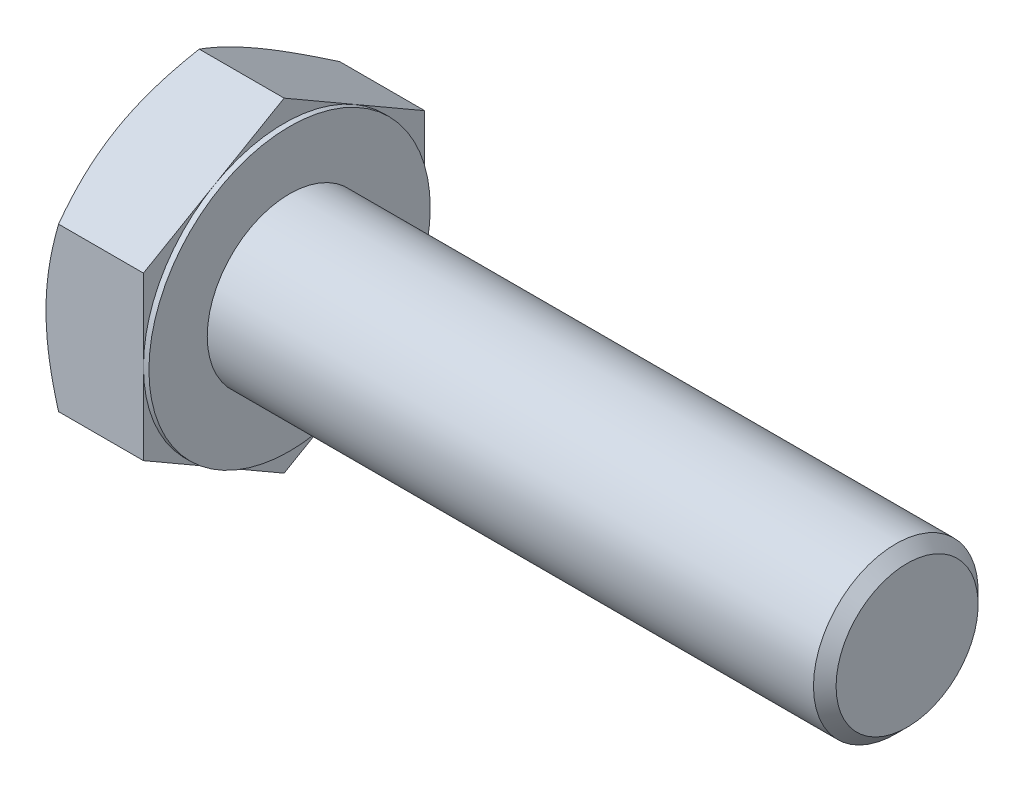
ISO-10303-21;
HEADER;
FILE_DESCRIPTION(('STEP AP214'),'2;1');
FILE_NAME('part.step','',(''),(''),'','','');
FILE_SCHEMA(('AUTOMOTIVE_DESIGN { 1 0 10303 214 1 1 1 1 }'));
ENDSEC;
DATA;
#1=APPLICATION_CONTEXT('core data for automotive mechanical design processes');
#2=APPLICATION_PROTOCOL_DEFINITION('international standard','automotive_design',2000,#1);
#3=PRODUCT_CONTEXT('',#1,'mechanical');
#4=PRODUCT('Part','Part','',(#3));
#5=PRODUCT_RELATED_PRODUCT_CATEGORY('part','',(#4));
#6=PRODUCT_DEFINITION_FORMATION('','',#4);
#7=PRODUCT_DEFINITION_CONTEXT('part definition',#1,'design');
#8=PRODUCT_DEFINITION('design','',#6,#7);
#9=PRODUCT_DEFINITION_SHAPE('','',#8);
#10=(LENGTH_UNIT() NAMED_UNIT(*) SI_UNIT(.MILLI.,.METRE.));
#11=(NAMED_UNIT(*) PLANE_ANGLE_UNIT() SI_UNIT($,.RADIAN.));
#12=(NAMED_UNIT(*) SI_UNIT($,.STERADIAN.) SOLID_ANGLE_UNIT());
#13=UNCERTAINTY_MEASURE_WITH_UNIT(LENGTH_MEASURE(1.E-05),#10,'distance_accuracy_value','');
#14=(GEOMETRIC_REPRESENTATION_CONTEXT(3) GLOBAL_UNCERTAINTY_ASSIGNED_CONTEXT((#13)) GLOBAL_UNIT_ASSIGNED_CONTEXT((#10,
#11,#12)) REPRESENTATION_CONTEXT('',''));
#15=CARTESIAN_POINT('',(0.,0.,0.));
#16=DIRECTION('',(0.,0.,1.));
#17=DIRECTION('',(1.,0.,0.));
#18=AXIS2_PLACEMENT_3D('',#15,#16,#17);
#19=CARTESIAN_POINT('',(-4.47600888718708,4.97835272816649,2.05991909307157));
#20=DIRECTION('',(1.,0.,0.));
#21=DIRECTION('',(0.,0.,-1.));
#22=AXIS2_PLACEMENT_3D('',#19,#20,#21);
#23=PLANE('',#22);
#24=CARTESIAN_POINT('',(-4.47600888718708,2.01943259856965,2.05991909307157));
#25=DIRECTION('',(1.,0.,0.));
#26=DIRECTION('',(0.,0.,-1.));
#27=AXIS2_PLACEMENT_3D('',#24,#25,#26);
#28=CIRCLE('',#27,1.5);
#29=CARTESIAN_POINT('',(-4.47600888718708,2.01943259856965,0.559919093071569));
#30=VERTEX_POINT('',#29);
#31=EDGE_CURVE('E278',#30,#30,#28,.F.);
#32=ORIENTED_EDGE('',*,*,#31,.T.);
#33=EDGE_LOOP('',(#32));
#34=FACE_BOUND('',#33,.T.);
#35=CARTESIAN_POINT('',(-4.47600888718708,2.01943259856965,2.05991909307157));
#36=DIRECTION('',(1.,0.,0.));
#37=DIRECTION('',(0.,0.,-1.));
#38=AXIS2_PLACEMENT_3D('',#35,#36,#37);
#39=CIRCLE('',#38,2.5625);
#40=CARTESIAN_POINT('',(-4.47600888718708,2.01943259856965,-0.502580906928431));
#41=VERTEX_POINT('',#40);
#42=EDGE_CURVE('E297',#41,#41,#39,.T.);
#43=ORIENTED_EDGE('',*,*,#42,.T.);
#44=EDGE_LOOP('',(#43));
#45=FACE_BOUND('',#44,.T.);
#46=ADVANCED_FACE('F34',(#34,#45),#23,.T.);
#47=CARTESIAN_POINT('',(-6.35100888718708,2.01943259856965,2.05991909307157));
#48=DIRECTION('',(-1.,0.,0.));
#49=DIRECTION('',(0.,0.,1.));
#50=AXIS2_PLACEMENT_3D('',#47,#48,#49);
#51=CYLINDRICAL_SURFACE('',#50,1.5);
#52=ORIENTED_EDGE('',*,*,#31,.F.);
#53=EDGE_LOOP('',(#52));
#54=FACE_BOUND('',#53,.T.);
#55=CARTESIAN_POINT('',(6.56799111281292,2.01943259856965,2.05991909307157));
#56=DIRECTION('',(-1.,0.,0.));
#57=DIRECTION('',(0.,0.,1.));
#58=AXIS2_PLACEMENT_3D('',#55,#56,#57);
#59=CIRCLE('',#58,1.5);
#60=CARTESIAN_POINT('',(6.56799111281292,2.01943259856965,3.55991909307157));
#61=VERTEX_POINT('',#60);
#62=EDGE_CURVE('E275',#61,#61,#59,.T.);
#63=ORIENTED_EDGE('',*,*,#62,.T.);
#64=EDGE_LOOP('',(#63));
#65=FACE_BOUND('',#64,.T.);
#66=ADVANCED_FACE('F249',(#54,#65),#51,.T.);
#67=CARTESIAN_POINT('',(6.77399111281292,2.01943259856965,2.05991909307157));
#68=DIRECTION('',(-1.,0.,0.));
#69=DIRECTION('',(0.,0.,1.));
#70=AXIS2_PLACEMENT_3D('',#67,#68,#69);
#71=CONICAL_SURFACE('',#70,1.294,0.785398163397449);
#72=ORIENTED_EDGE('',*,*,#62,.F.);
#73=EDGE_LOOP('',(#72));
#74=FACE_BOUND('',#73,.T.);
#75=CARTESIAN_POINT('',(6.77399111281292,2.01943259856965,2.05991909307157));
#76=DIRECTION('',(-1.,0.,0.));
#77=DIRECTION('',(0.,0.,1.));
#78=AXIS2_PLACEMENT_3D('',#75,#76,#77);
#79=CIRCLE('',#78,1.294);
#80=CARTESIAN_POINT('',(6.77399111281292,2.01943259856965,3.35391909307157));
#81=VERTEX_POINT('',#80);
#82=EDGE_CURVE('E273',#81,#81,#79,.T.);
#83=ORIENTED_EDGE('',*,*,#82,.T.);
#84=EDGE_LOOP('',(#83));
#85=FACE_BOUND('',#84,.T.);
#86=ADVANCED_FACE('F254',(#74,#85),#71,.T.);
#87=CARTESIAN_POINT('',(6.77399111281292,2.01943259856965,2.05991909307157));
#88=DIRECTION('',(-1.,0.,0.));
#89=DIRECTION('',(0.,0.,1.));
#90=AXIS2_PLACEMENT_3D('',#87,#88,#89);
#91=PLANE('',#90);
#92=ORIENTED_EDGE('',*,*,#82,.F.);
#93=EDGE_LOOP('',(#92));
#94=FACE_BOUND('',#93,.T.);
#95=ADVANCED_FACE('F261',(#94),#91,.F.);
#96=CARTESIAN_POINT('',(-4.57600888718708,4.58193259856965,2.05991909307157));
#97=DIRECTION('',(1.,0.,0.));
#98=DIRECTION('',(0.,0.,-1.));
#99=AXIS2_PLACEMENT_3D('',#96,#97,#98);
#100=PLANE('',#99);
#101=DIRECTION('',(0.,0.500000000000001,0.866025403784438));
#102=VECTOR('',#101,1.);
#103=CARTESIAN_POINT('',(-4.57600888718708,3.49889266336807,-0.502580906928431));
#104=LINE('',#103,#102);
#105=CARTESIAN_POINT('',(-4.57600888718708,3.49889266336807,-0.502580906928431));
#106=VERTEX_POINT('',#105);
#107=CARTESIAN_POINT('',(-4.57600888718708,4.23862269576728,0.778669093071566));
#108=VERTEX_POINT('',#107);
#109=EDGE_CURVE('E167',#106,#108,#104,.T.);
#110=ORIENTED_EDGE('',*,*,#109,.T.);
#111=CARTESIAN_POINT('',(-4.57600888718708,2.01943259856965,2.05991909307157));
#112=DIRECTION('',(-1.,0.,0.));
#113=DIRECTION('',(0.,0.,1.));
#114=AXIS2_PLACEMENT_3D('',#111,#112,#113);
#115=CIRCLE('',#114,2.5625);
#116=CARTESIAN_POINT('',(-4.57600888718708,2.01943259856965,-0.502580906928431));
#117=VERTEX_POINT('',#116);
#118=EDGE_CURVE('E50',#108,#117,#115,.T.);
#119=ORIENTED_EDGE('',*,*,#118,.T.);
#120=DIRECTION('',(0.,1.,0.));
#121=VECTOR('',#120,1.);
#122=CARTESIAN_POINT('',(-4.57600888718708,3.49889266336807,-0.502580906928431));
#123=LINE('',#122,#121);
#124=EDGE_CURVE('E39',#117,#106,#123,.T.);
#125=ORIENTED_EDGE('',*,*,#124,.T.);
#126=EDGE_LOOP('',(#110,#119,#125));
#127=FACE_BOUND('',#126,.T.);
#128=ADVANCED_FACE('F264',(#127),#100,.T.);
#129=CARTESIAN_POINT('',(-4.57600888718708,4.97835272816649,2.05991909307157));
#130=VERTEX_POINT('',#129);
#131=EDGE_CURVE('E165',#108,#130,#104,.T.);
#132=ORIENTED_EDGE('',*,*,#131,.T.);
#133=DIRECTION('',(0.,-0.500000000000001,0.866025403784438));
#134=VECTOR('',#133,1.);
#135=CARTESIAN_POINT('',(-4.57600888718708,4.97835272816649,2.05991909307157));
#136=LINE('',#135,#134);
#137=CARTESIAN_POINT('',(-4.57600888718708,4.23862269576728,3.34116909307157));
#138=VERTEX_POINT('',#137);
#139=EDGE_CURVE('E164',#130,#138,#136,.T.);
#140=ORIENTED_EDGE('',*,*,#139,.T.);
#141=EDGE_CURVE('E153',#138,#108,#115,.T.);
#142=ORIENTED_EDGE('',*,*,#141,.T.);
#143=EDGE_LOOP('',(#132,#140,#142));
#144=FACE_BOUND('',#143,.T.);
#145=ADVANCED_FACE('F269',(#144),#100,.T.);
#146=CARTESIAN_POINT('',(-4.57600888718708,3.49889266336807,4.62241909307157));
#147=VERTEX_POINT('',#146);
#148=EDGE_CURVE('E132',#138,#147,#136,.T.);
#149=ORIENTED_EDGE('',*,*,#148,.T.);
#150=DIRECTION('',(0.,-1.,0.));
#151=VECTOR('',#150,1.);
#152=CARTESIAN_POINT('',(-4.57600888718708,3.49889266336807,4.62241909307157));
#153=LINE('',#152,#151);
#154=CARTESIAN_POINT('',(-4.57600888718708,2.01943259856965,4.62241909307157));
#155=VERTEX_POINT('',#154);
#156=EDGE_CURVE('E126',#147,#155,#153,.T.);
#157=ORIENTED_EDGE('',*,*,#156,.T.);
#158=EDGE_CURVE('E130',#155,#138,#115,.T.);
#159=ORIENTED_EDGE('',*,*,#158,.T.);
#160=EDGE_LOOP('',(#149,#157,#159));
#161=FACE_BOUND('',#160,.T.);
#162=ADVANCED_FACE('F128',(#161),#100,.T.);
#163=CARTESIAN_POINT('',(-4.57600888718708,0.539972533771243,4.62241909307157));
#164=VERTEX_POINT('',#163);
#165=EDGE_CURVE('E136',#155,#164,#153,.T.);
#166=ORIENTED_EDGE('',*,*,#165,.T.);
#167=DIRECTION('',(0.,-0.500000000000002,-0.866025403784438));
#168=VECTOR('',#167,1.);
#169=CARTESIAN_POINT('',(-4.57600888718708,-0.939487531027181,2.05991909307157));
#170=LINE('',#169,#168);
#171=CARTESIAN_POINT('',(-4.57600888718708,-0.199757498627968,3.34116909307157));
#172=VERTEX_POINT('',#171);
#173=EDGE_CURVE('E143',#164,#172,#170,.T.);
#174=ORIENTED_EDGE('',*,*,#173,.T.);
#175=EDGE_CURVE('E140',#172,#155,#115,.T.);
#176=ORIENTED_EDGE('',*,*,#175,.T.);
#177=EDGE_LOOP('',(#166,#174,#176));
#178=FACE_BOUND('',#177,.T.);
#179=ADVANCED_FACE('F141',(#178),#100,.T.);
#180=CARTESIAN_POINT('',(-4.57600888718708,-0.939487531027181,2.05991909307157));
#181=VERTEX_POINT('',#180);
#182=EDGE_CURVE('E159',#172,#181,#170,.T.);
#183=ORIENTED_EDGE('',*,*,#182,.T.);
#184=DIRECTION('',(0.,0.5,-0.866025403784439));
#185=VECTOR('',#184,1.);
#186=CARTESIAN_POINT('',(-4.57600888718708,0.539972533771235,-0.502580906928431));
#187=LINE('',#186,#185);
#188=CARTESIAN_POINT('',(-4.57600888718708,-0.199757498627971,0.778669093071569));
#189=VERTEX_POINT('',#188);
#190=EDGE_CURVE('E333',#181,#189,#187,.T.);
#191=ORIENTED_EDGE('',*,*,#190,.T.);
#192=EDGE_CURVE('E147',#189,#172,#115,.T.);
#193=ORIENTED_EDGE('',*,*,#192,.T.);
#194=EDGE_LOOP('',(#183,#191,#193));
#195=FACE_BOUND('',#194,.T.);
#196=ADVANCED_FACE('F338',(#195),#100,.T.);
#197=CARTESIAN_POINT('',(-4.57600888718708,0.539972533771235,-0.502580906928431));
#198=VERTEX_POINT('',#197);
#199=EDGE_CURVE('E154',#189,#198,#187,.T.);
#200=ORIENTED_EDGE('',*,*,#199,.T.);
#201=EDGE_CURVE('E11',#198,#117,#123,.T.);
#202=ORIENTED_EDGE('',*,*,#201,.T.);
#203=EDGE_CURVE('E351',#117,#189,#115,.T.);
#204=ORIENTED_EDGE('',*,*,#203,.T.);
#205=EDGE_LOOP('',(#200,#202,#204));
#206=FACE_BOUND('',#205,.T.);
#207=ADVANCED_FACE('F270',(#206),#100,.T.);
#208=CARTESIAN_POINT('',(-6.35100888718708,2.01943259856965,2.05991909307157));
#209=DIRECTION('',(-1.,0.,0.));
#210=DIRECTION('',(0.,0.,1.));
#211=AXIS2_PLACEMENT_3D('',#208,#209,#210);
#212=CYLINDRICAL_SURFACE('',#211,2.5625);
#213=ORIENTED_EDGE('',*,*,#118,.F.);
#214=ORIENTED_EDGE('',*,*,#141,.F.);
#215=ORIENTED_EDGE('',*,*,#158,.F.);
#216=ORIENTED_EDGE('',*,*,#175,.F.);
#217=ORIENTED_EDGE('',*,*,#192,.F.);
#218=ORIENTED_EDGE('',*,*,#203,.F.);
#219=EDGE_LOOP('',(#213,#214,#215,#216,#217,#218));
#220=FACE_BOUND('',#219,.T.);
#221=ORIENTED_EDGE('',*,*,#42,.F.);
#222=EDGE_LOOP('',(#221));
#223=FACE_BOUND('',#222,.T.);
#224=ADVANCED_FACE('F150',(#220,#223),#212,.T.);
#225=CARTESIAN_POINT('',(-6.35100888718708,4.97835272816649,2.05991909307157));
#226=DIRECTION('',(1.,0.,0.));
#227=DIRECTION('',(0.,0.,-1.));
#228=AXIS2_PLACEMENT_3D('',#225,#226,#227);
#229=PLANE('',#228);
#230=CARTESIAN_POINT('',(-6.35100888718708,2.01943259856965,2.05991909307157));
#231=DIRECTION('',(1.,0.,0.));
#232=DIRECTION('',(0.,0.,-1.));
#233=AXIS2_PLACEMENT_3D('',#230,#231,#232);
#234=CIRCLE('',#233,2.5625);
#235=CARTESIAN_POINT('',(-6.35100888718708,2.01943259856965,-0.502580906928431));
#236=VERTEX_POINT('',#235);
#237=CARTESIAN_POINT('',(-6.35100888718708,4.23862269576728,0.778669093071566));
#238=VERTEX_POINT('',#237);
#239=EDGE_CURVE('E296',#236,#238,#234,.T.);
#240=ORIENTED_EDGE('',*,*,#239,.F.);
#241=CARTESIAN_POINT('',(-6.35100888718708,-0.199757498627971,0.778669093071569));
#242=VERTEX_POINT('',#241);
#243=EDGE_CURVE('E293',#242,#236,#234,.T.);
#244=ORIENTED_EDGE('',*,*,#243,.F.);
#245=CARTESIAN_POINT('',(-6.35100888718708,-0.199757498627968,3.34116909307157));
#246=VERTEX_POINT('',#245);
#247=EDGE_CURVE('E295',#246,#242,#234,.T.);
#248=ORIENTED_EDGE('',*,*,#247,.F.);
#249=CARTESIAN_POINT('',(-6.35100888718708,2.01943259856965,4.62241909307157));
#250=VERTEX_POINT('',#249);
#251=EDGE_CURVE('E305',#250,#246,#234,.T.);
#252=ORIENTED_EDGE('',*,*,#251,.F.);
#253=CARTESIAN_POINT('',(-6.35100888718708,2.01943259856965,2.05991909307157));
#254=DIRECTION('',(-1.,0.,0.));
#255=DIRECTION('',(0.,0.,1.));
#256=AXIS2_PLACEMENT_3D('',#253,#254,#255);
#257=CIRCLE('',#256,2.5625);
#258=CARTESIAN_POINT('',(-6.35100888718708,4.23862269576728,3.34116909307157));
#259=VERTEX_POINT('',#258);
#260=EDGE_CURVE('E168',#250,#259,#257,.T.);
#261=ORIENTED_EDGE('',*,*,#260,.T.);
#262=EDGE_CURVE('E300',#238,#259,#234,.T.);
#263=ORIENTED_EDGE('',*,*,#262,.F.);
#264=EDGE_LOOP('',(#240,#244,#248,#252,#261,#263));
#265=FACE_BOUND('',#264,.T.);
#266=ADVANCED_FACE('F199',(#265),#229,.F.);
#267=CARTESIAN_POINT('',(-6.35100888718708,2.01943259856965,2.05991909307157));
#268=DIRECTION('',(1.,0.,0.));
#269=DIRECTION('',(0.,0.,-1.));
#270=AXIS2_PLACEMENT_3D('',#267,#268,#269);
#271=CONICAL_SURFACE('',#270,2.5625,1.0471975511966);
#272=CARTESIAN_POINT('',(-6.12212728525785,3.49887822961134,4.62244409307157));
#273=CARTESIAN_POINT('',(-6.15967430252766,3.56389178310159,4.50983731524585));
#274=CARTESIAN_POINT('',(-6.19382145420713,3.62946653212411,4.39625851824528));
#275=CARTESIAN_POINT('',(-6.25342452180534,3.7617514329413,4.1671343489557));
#276=CARTESIAN_POINT('',(-6.27885935430446,3.82846393456461,4.0515849066441));
#277=CARTESIAN_POINT('',(-6.31845083308344,3.96106219590785,3.82191798100231));
#278=CARTESIAN_POINT('',(-6.33287100775529,4.0269275584089,3.70783582669155));
#279=CARTESIAN_POINT('',(-6.35008303511766,4.15896806864342,3.47913495430804));
#280=CARTESIAN_POINT('',(-6.35288914367342,4.22514273671679,3.36451706703096));
#281=CARTESIAN_POINT('',(-6.34703919670195,4.34878490743399,3.15036254539066));
#282=CARTESIAN_POINT('',(-6.3398194978504,4.40627095570174,3.05079378906457));
#283=CARTESIAN_POINT('',(-6.31694110218889,4.52086854614647,2.85230493998932));
#284=CARTESIAN_POINT('',(-6.30127459645005,4.57797969220324,2.75338553334052));
#285=CARTESIAN_POINT('',(-6.26211104366984,4.69281339914852,2.55448771848981));
#286=CARTESIAN_POINT('',(-6.23844804845488,4.75052143227063,2.45453447311745));
#287=CARTESIAN_POINT('',(-6.18474293010332,4.86507699056739,2.25611842585805));
#288=CARTESIAN_POINT('',(-6.15471341891318,4.9219259824054,2.15765308363554));
#289=CARTESIAN_POINT('',(-6.12212728525785,4.97836716192322,2.05989409307157));
#290=B_SPLINE_CURVE_WITH_KNOTS('',3,(#272,#273,#274,#275,#276,#277,#278,#279,#280,#281,#282,
#283,#284,#285,#286,#287,#288,#289),.UNSPECIFIED.,.F.,.F.,(4,2,2,2,2,2,2,2,4),(0.,
0.406178741324011,0.813333585226369,1.21041241519314,1.60700369979029,1.95227093241698,
2.29785790739485,2.65110873948759,3.00366622009843),.UNSPECIFIED.);
#291=CARTESIAN_POINT('',(-6.12213561865216,4.97835272816649,2.05991909307157));
#292=VERTEX_POINT('',#291);
#293=EDGE_CURVE('E218',#259,#292,#290,.T.);
#294=ORIENTED_EDGE('',*,*,#293,.T.);
#295=CARTESIAN_POINT('',(-6.12212728525785,4.97836716192322,2.05994409307157));
#296=CARTESIAN_POINT('',(-6.15967430252766,4.91335360843296,1.94733731524585));
#297=CARTESIAN_POINT('',(-6.19382145420713,4.84777885941045,1.83375851824528));
#298=CARTESIAN_POINT('',(-6.25342452180534,4.71549395859326,1.60463434895569));
#299=CARTESIAN_POINT('',(-6.27885935430446,4.64878145696995,1.4890849066441));
#300=CARTESIAN_POINT('',(-6.31845083308344,4.51618319562671,1.25941798100231));
#301=CARTESIAN_POINT('',(-6.33287100775529,4.45031783312565,1.14533582669155));
#302=CARTESIAN_POINT('',(-6.35008303511766,4.31827732289113,0.91663495430804));
#303=CARTESIAN_POINT('',(-6.35288914367342,4.25210265481777,0.802017067030962));
#304=CARTESIAN_POINT('',(-6.34703919670195,4.12846048410056,0.587862545390657));
#305=CARTESIAN_POINT('',(-6.3398194978504,4.07097443583282,0.488293789064571));
#306=CARTESIAN_POINT('',(-6.31694110218889,3.95637684538808,0.289804939989322));
#307=CARTESIAN_POINT('',(-6.30127459645005,3.89926569933132,0.190885533340514));
#308=CARTESIAN_POINT('',(-6.26211104366984,3.78443199238603,-0.00801228151019305));
#309=CARTESIAN_POINT('',(-6.23844804845488,3.72672395926392,-0.107965526882551));
#310=CARTESIAN_POINT('',(-6.18474293010332,3.61216840096716,-0.306381574141954));
#311=CARTESIAN_POINT('',(-6.15471341891318,3.55531940912915,-0.404846916364457));
#312=CARTESIAN_POINT('',(-6.12212728525786,3.49887822961134,-0.502605906928431));
#313=B_SPLINE_CURVE_WITH_KNOTS('',3,(#295,#296,#297,#298,#299,#300,#301,#302,#303,#304,#305,
#306,#307,#308,#309,#310,#311,#312),.UNSPECIFIED.,.F.,.F.,(4,2,2,2,2,2,2,2,4),(0.,
0.406178741324011,0.813333585226369,1.21041241519314,1.60700369979029,1.95227093241698,
2.29785790739485,2.65110873948759,3.00366622009843),.UNSPECIFIED.);
#314=EDGE_CURVE('E58',#292,#238,#313,.T.);
#315=ORIENTED_EDGE('',*,*,#314,.T.);
#316=ORIENTED_EDGE('',*,*,#262,.T.);
#317=EDGE_LOOP('',(#294,#315,#316));
#318=FACE_BOUND('',#317,.T.);
#319=ADVANCED_FACE('F347',(#318),#271,.T.);
#320=CARTESIAN_POINT('',(-5.10043719001082,-1.95458476603406,4.62241909307157));
#321=CARTESIAN_POINT('',(-5.15472794712821,-1.84266580654332,4.62241909307157));
#322=CARTESIAN_POINT('',(-5.20849815481982,-1.73048993435055,4.62241909307157));
#323=CARTESIAN_POINT('',(-5.31470471400024,-1.50548774639538,4.62241909307157));
#324=CARTESIAN_POINT('',(-5.36714085529542,-1.39266133152761,4.62241909307157));
#325=CARTESIAN_POINT('',(-5.47065033618764,-1.16564010833416,4.62241909307157));
#326=CARTESIAN_POINT('',(-5.5217147020397,-1.05144119428322,4.62241909307157));
#327=CARTESIAN_POINT('',(-5.62175380140549,-0.822135097011588,4.62241909307157));
#328=CARTESIAN_POINT('',(-5.67072863363351,-0.707027957002641,4.62241909307157));
#329=CARTESIAN_POINT('',(-5.76756999120564,-0.472001967574954,4.62241909307157));
#330=CARTESIAN_POINT('',(-5.81535027898596,-0.352047389302698,4.62241909307157));
#331=CARTESIAN_POINT('',(-5.90729466933226,-0.110734802527193,4.62241909307157));
#332=CARTESIAN_POINT('',(-5.95145836601986,0.0106233617565875,4.62241909307157));
#333=CARTESIAN_POINT('',(-6.0350101841829,0.254708989969266,4.62241909307157));
#334=CARTESIAN_POINT('',(-6.0744079739217,0.37743311082192,4.62241909307157));
#335=CARTESIAN_POINT('',(-6.14716371004089,0.624641841416334,4.62241909307157));
#336=CARTESIAN_POINT('',(-6.18052355887469,0.749125883262034,4.62241909307157));
#337=CARTESIAN_POINT('',(-6.23942419083917,0.999231262194881,4.62241909307157));
#338=CARTESIAN_POINT('',(-6.26500753115608,1.12484238889012,4.62241909307157));
#339=CARTESIAN_POINT('',(-6.30691017363103,1.37762690061821,4.62241909307157));
#340=CARTESIAN_POINT('',(-6.32323034958245,1.50480013714081,4.62241909307157));
#341=CARTESIAN_POINT('',(-6.34509116778556,1.75841259966283,4.62241909307157));
#342=CARTESIAN_POINT('',(-6.35077036000466,1.88483958214877,4.62241909307157));
#343=CARTESIAN_POINT('',(-6.35123244574984,2.1377238975588,4.62241909307157));
#344=CARTESIAN_POINT('',(-6.34601514045229,2.26418123099459,4.62241909307157));
#345=CARTESIAN_POINT('',(-6.32827639411466,2.47886960845516,4.62241909307157));
#346=CARTESIAN_POINT('',(-6.31837563699909,2.56733051612281,4.62241909307157));
#347=CARTESIAN_POINT('',(-6.29385861262692,2.74360264903072,4.62241909307157));
#348=CARTESIAN_POINT('',(-6.27924170401044,2.83141378424461,4.62241909307157));
#349=CARTESIAN_POINT('',(-6.22908297947897,3.09374545847331,4.62241909307157));
#350=CARTESIAN_POINT('',(-6.18724242504255,3.26706525884252,4.62241909307157));
#351=CARTESIAN_POINT('',(-6.09024075931708,3.61392735805778,4.62241909307157));
#352=CARTESIAN_POINT('',(-6.0348059838471,3.78739010753215,4.62241909307157));
#353=CARTESIAN_POINT('',(-5.9449630990784,4.04517653692337,4.62241909307157));
#354=CARTESIAN_POINT('',(-5.91390391802054,4.13069532110287,4.62241909307157));
#355=CARTESIAN_POINT('',(-5.84990612968219,4.30102675786979,4.62241909307157));
#356=CARTESIAN_POINT('',(-5.81696754320222,4.3858394182604,4.62241909307157));
#357=CARTESIAN_POINT('',(-5.73787838611346,4.58402949091074,4.62241909307157));
#358=CARTESIAN_POINT('',(-5.69109448792066,4.6971534089306,4.62241909307157));
#359=CARTESIAN_POINT('',(-5.59528553974671,4.92245052401759,4.62241909307157));
#360=CARTESIAN_POINT('',(-5.54626036641185,5.03462366835296,4.62241909307157));
#361=CARTESIAN_POINT('',(-5.3965099882294,5.36999702662015,4.62241909307157));
#362=CARTESIAN_POINT('',(-5.29312718753616,5.59200896319531,4.62241909307157));
#363=CARTESIAN_POINT('',(-5.08164346423167,6.03402088506048,4.62241909307157));
#364=CARTESIAN_POINT('',(-4.97353795279787,6.25401865048703,4.62241909307157));
#365=CARTESIAN_POINT('',(-4.75414311474761,6.69242674909987,4.62241909307157));
#366=CARTESIAN_POINT('',(-4.64285367331659,6.9108370246832,4.62241909307157));
#367=CARTESIAN_POINT('',(-4.42730090112833,7.32850465237526,4.62241909307157));
#368=CARTESIAN_POINT('',(-4.32321611548087,7.52785447008971,4.62241909307157));
#369=CARTESIAN_POINT('',(-4.11361383485968,7.92580736024032,4.62241909307157));
#370=CARTESIAN_POINT('',(-4.00809629106268,8.12441040693323,4.62241909307157));
#371=CARTESIAN_POINT('',(-3.79622676777696,8.52054718351385,4.62241909307157));
#372=CARTESIAN_POINT('',(-3.689877451815,8.71808234007904,4.62241909307157));
#373=CARTESIAN_POINT('',(-3.47631928853795,9.11267385589296,4.62241909307157));
#374=CARTESIAN_POINT('',(-3.36911048808578,9.30973024049325,4.62241909307157));
#375=CARTESIAN_POINT('',(-3.26158032673679,9.50660987440475,4.62241909307157));
#376=B_SPLINE_CURVE_WITH_KNOTS('',3,(#320,#321,#322,#323,#324,#325,#326,#327,#328,#329,#330,
#331,#332,#333,#334,#335,#336,#337,#338,#339,#340,#341,#342,#343,#344,#345,#346,#347,#348,#349,
#350,#351,#352,#353,#354,#355,#356,#357,#358,#359,#360,#361,#362,#363,#364,#365,#366,#367,#368,
#369,#370,#371,#372,#373,#374,#375),.UNSPECIFIED.,.F.,.F.,(4,2,2,2,2,2,2,2,2,2,2,2,2,2,2,2,2,2,
2,2,2,2,2,2,2,2,2,4),(0.,0.373180199730335,0.746418837580578,1.12168950151272,1.49694241713475,
1.88425830445698,2.27161759959219,2.65817741738062,3.0446152238439,3.42889849735961,
3.81314551544469,4.19235374615038,4.57156889616282,4.83848016211848,5.10542774123805,
5.63961982769652,6.18560429879044,6.45853993570418,6.7314725524625,7.09868982678375,
7.46592733613843,8.20053907194647,8.93588119988995,9.67124987824968,10.3459029629973,
11.0205790954923,11.6936093710184,12.3666031961891),.UNSPECIFIED.);
#377=CARTESIAN_POINT('',(-6.12213561865216,3.49889266336807,4.62241909307157));
#378=VERTEX_POINT('',#377);
#379=EDGE_CURVE('E232',#250,#378,#376,.T.);
#380=ORIENTED_EDGE('',*,*,#379,.T.);
#381=EDGE_CURVE('E231',#378,#259,#290,.T.);
#382=ORIENTED_EDGE('',*,*,#381,.T.);
#383=ORIENTED_EDGE('',*,*,#260,.F.);
#384=EDGE_LOOP('',(#380,#382,#383));
#385=FACE_BOUND('',#384,.T.);
#386=ADVANCED_FACE('F343',(#385),#271,.T.);
#387=CARTESIAN_POINT('',(-6.12213561865217,0.539972533771243,4.62241909307157));
#388=VERTEX_POINT('',#387);
#389=EDGE_CURVE('E276',#388,#250,#376,.T.);
#390=ORIENTED_EDGE('',*,*,#389,.T.);
#391=ORIENTED_EDGE('',*,*,#251,.T.);
#392=CARTESIAN_POINT('',(-6.12212728525785,-0.93950196478391,2.05989409307157));
#393=CARTESIAN_POINT('',(-6.15967430252766,-0.874488411293655,2.17250087089729));
#394=CARTESIAN_POINT('',(-6.19382145420713,-0.80891366227114,2.28607966789786));
#395=CARTESIAN_POINT('',(-6.25342452180534,-0.67662876145395,2.51520383718744));
#396=CARTESIAN_POINT('',(-6.27885935430446,-0.60991625983064,2.63075327949904));
#397=CARTESIAN_POINT('',(-6.31845083308344,-0.477317998487399,2.86042020514082));
#398=CARTESIAN_POINT('',(-6.33287100775529,-0.411452635986345,2.97450235945159));
#399=CARTESIAN_POINT('',(-6.35008303511766,-0.279412125751825,3.2032032318351));
#400=CARTESIAN_POINT('',(-6.35288914367342,-0.213237457678457,3.31782111911218));
#401=CARTESIAN_POINT('',(-6.34703919670195,-0.0895952869612511,3.53197564075248));
#402=CARTESIAN_POINT('',(-6.3398194978504,-0.0321092386935091,3.63154439707857));
#403=CARTESIAN_POINT('',(-6.31694110218889,0.0824883517512258,3.83003324615382));
#404=CARTESIAN_POINT('',(-6.30127459645005,0.139599497807993,3.92895265280262));
#405=CARTESIAN_POINT('',(-6.26211104366984,0.254433204753278,4.12785046765333));
#406=CARTESIAN_POINT('',(-6.23844804845488,0.312141237875386,4.22780371302569));
#407=CARTESIAN_POINT('',(-6.18474293010332,0.426696796172145,4.42621976028509));
#408=CARTESIAN_POINT('',(-6.15471341891318,0.483545788010156,4.5246851025076));
#409=CARTESIAN_POINT('',(-6.12212728525786,0.539986967527973,4.62244409307157));
#410=B_SPLINE_CURVE_WITH_KNOTS('',3,(#392,#393,#394,#395,#396,#397,#398,#399,#400,#401,#402,
#403,#404,#405,#406,#407,#408,#409),.UNSPECIFIED.,.F.,.F.,(4,2,2,2,2,2,2,2,4),(0.,
0.406178741324011,0.81333358522637,1.21041241519314,1.60700369979029,1.95227093241698,
2.29785790739485,2.6511087394876,3.00366622009843),.UNSPECIFIED.);
#411=EDGE_CURVE('E220',#246,#388,#410,.T.);
#412=ORIENTED_EDGE('',*,*,#411,.T.);
#413=EDGE_LOOP('',(#390,#391,#412));
#414=FACE_BOUND('',#413,.T.);
#415=ADVANCED_FACE('F188',(#414),#271,.T.);
#416=CARTESIAN_POINT('',(-6.12213561865216,-0.939487531027181,2.05991909307157));
#417=VERTEX_POINT('',#416);
#418=EDGE_CURVE('E212',#417,#246,#410,.T.);
#419=ORIENTED_EDGE('',*,*,#418,.T.);
#420=ORIENTED_EDGE('',*,*,#247,.T.);
#421=CARTESIAN_POINT('',(-6.12212728525785,0.539986967527965,-0.502605906928431));
#422=CARTESIAN_POINT('',(-6.15967430252766,0.47497341403771,-0.389999129102713));
#423=CARTESIAN_POINT('',(-6.19382145420713,0.409398665015195,-0.276420332102139));
#424=CARTESIAN_POINT('',(-6.25342452180534,0.277113764198005,-0.0472961628125569));
#425=CARTESIAN_POINT('',(-6.27885935430446,0.210401262574695,0.0682532794990367));
#426=CARTESIAN_POINT('',(-6.31845083308344,0.0778030012314549,0.297920205140825));
#427=CARTESIAN_POINT('',(-6.33287100775529,0.0119376387304017,0.412002359451592));
#428=CARTESIAN_POINT('',(-6.35008303511766,-0.120102871504118,0.640703231835099));
#429=CARTESIAN_POINT('',(-6.35288914367341,-0.186277539577486,0.755321119112177));
#430=CARTESIAN_POINT('',(-6.34703919670195,-0.309919710294691,0.969475640752482));
#431=CARTESIAN_POINT('',(-6.3398194978504,-0.367405758562433,1.06904439707857));
#432=CARTESIAN_POINT('',(-6.31694110218889,-0.482003349007167,1.26753324615382));
#433=CARTESIAN_POINT('',(-6.30127459645005,-0.539114495063934,1.36645265280262));
#434=CARTESIAN_POINT('',(-6.26211104366984,-0.653948202009218,1.56535046765333));
#435=CARTESIAN_POINT('',(-6.23844804845488,-0.711656235131326,1.66530371302569));
#436=CARTESIAN_POINT('',(-6.18474293010332,-0.826211793428084,1.86371976028509));
#437=CARTESIAN_POINT('',(-6.15471341891318,-0.883060785266094,1.9621851025076));
#438=CARTESIAN_POINT('',(-6.12212728525785,-0.93950196478391,2.05994409307157));
#439=B_SPLINE_CURVE_WITH_KNOTS('',3,(#421,#422,#423,#424,#425,#426,#427,#428,#429,#430,#431,
#432,#433,#434,#435,#436,#437,#438),.UNSPECIFIED.,.F.,.F.,(4,2,2,2,2,2,2,2,4),(0.,
0.406178741324011,0.81333358522637,1.21041241519314,1.60700369979029,1.95227093241698,
2.29785790739485,2.65110873948759,3.00366622009843),.UNSPECIFIED.);
#440=EDGE_CURVE('E219',#242,#417,#439,.T.);
#441=ORIENTED_EDGE('',*,*,#440,.T.);
#442=EDGE_LOOP('',(#419,#420,#441));
#443=FACE_BOUND('',#442,.T.);
#444=ADVANCED_FACE('F314',(#443),#271,.T.);
#445=CARTESIAN_POINT('',(-6.12213561865216,3.49889266336807,-0.502580906928431));
#446=VERTEX_POINT('',#445);
#447=EDGE_CURVE('E221',#238,#446,#313,.T.);
#448=ORIENTED_EDGE('',*,*,#447,.T.);
#449=CARTESIAN_POINT('',(-5.10043718997273,-1.95458476611255,-0.502580906928432));
#450=CARTESIAN_POINT('',(-5.15472794709172,-1.84266580661918,-0.502580906928432));
#451=CARTESIAN_POINT('',(-5.20849815478492,-1.73048993442377,-0.502580906928432));
#452=CARTESIAN_POINT('',(-5.31470471396852,-1.50548774646331,-0.502580906928432));
#453=CARTESIAN_POINT('',(-5.36714085526528,-1.3926613315929,-0.502580906928432));
#454=CARTESIAN_POINT('',(-5.47065033616067,-1.16564010839412,-0.502580906928432));
#455=CARTESIAN_POINT('',(-5.52171470201432,-1.05144119434049,-0.502580906928432));
#456=CARTESIAN_POINT('',(-5.62175380138326,-0.822135097063458,-0.502580906928432));
#457=CARTESIAN_POINT('',(-5.67072863361283,-0.707027957051805,-0.502580906928432));
#458=CARTESIAN_POINT('',(-5.76756999118813,-0.472001967618502,-0.502580906928432));
#459=CARTESIAN_POINT('',(-5.81535027897005,-0.352047389343337,-0.502580906928432));
#460=CARTESIAN_POINT('',(-5.90729466931944,-0.110734802561965,-0.502580906928432));
#461=CARTESIAN_POINT('',(-5.95145836600856,0.0106233617247726,-0.502580906928432));
#462=CARTESIAN_POINT('',(-6.03501018417447,0.254708989943421,-0.502580906928432));
#463=CARTESIAN_POINT('',(-6.07440797391463,0.377433110799087,-0.502580906928431));
#464=CARTESIAN_POINT('',(-6.14716371003632,0.624641841399609,-0.502580906928431));
#465=CARTESIAN_POINT('',(-6.18052355887126,0.749125883248403,-0.502580906928431));
#466=CARTESIAN_POINT('',(-6.23942419083802,0.999231262189054,-0.502580906928431));
#467=CARTESIAN_POINT('',(-6.26500753115599,1.12484238888903,-0.502580906928431));
#468=CARTESIAN_POINT('',(-6.30691017363234,1.37762690062669,-0.502580906928431));
#469=CARTESIAN_POINT('',(-6.32323034958411,1.50480013715413,-0.502580906928431));
#470=CARTESIAN_POINT('',(-6.34509116778703,1.75841259968575,-0.502580906928431));
#471=CARTESIAN_POINT('',(-6.35077036000564,1.88483958217645,-0.502580906928431));
#472=CARTESIAN_POINT('',(-6.35123244574898,2.13772389759592,-0.502580906928431));
#473=CARTESIAN_POINT('',(-6.34601514045011,2.26418123103639,-0.502580906928431));
#474=CARTESIAN_POINT('',(-6.32827639410982,2.4788696085029,-0.502580906928431));
#475=CARTESIAN_POINT('',(-6.31837563699319,2.56733051617184,-0.502580906928431));
#476=CARTESIAN_POINT('',(-6.29385861261884,2.74360264908229,-0.502580906928431));
#477=CARTESIAN_POINT('',(-6.27924170400123,2.83141378429742,-0.502580906928431));
#478=CARTESIAN_POINT('',(-6.22908297946639,3.09374545852978,-0.502580906928431));
#479=CARTESIAN_POINT('',(-6.18724242502768,3.26706525890134,-0.502580906928431));
#480=CARTESIAN_POINT('',(-6.09024075929769,3.61392735812132,-0.502580906928431));
#481=CARTESIAN_POINT('',(-6.03480598382547,3.78739010759805,-0.502580906928431));
#482=CARTESIAN_POINT('',(-5.94496309905354,4.04517653699281,-0.502580906928431));
#483=CARTESIAN_POINT('',(-5.91390391799461,4.13069532117348,-0.502580906928431));
#484=CARTESIAN_POINT('',(-5.84990612965418,4.30102675794275,-0.502580906928431));
#485=CARTESIAN_POINT('',(-5.81696754317318,4.38583941833453,-0.502580906928431));
#486=CARTESIAN_POINT('',(-5.73787838608282,4.58402949098569,-0.502580906928431));
#487=CARTESIAN_POINT('',(-5.69109448788951,4.69715340900522,-0.502580906928431));
#488=CARTESIAN_POINT('',(-5.59528553971467,4.92245052409157,-0.502580906928431));
#489=CARTESIAN_POINT('',(-5.54626036637941,5.03462366842665,-0.502580906928431));
#490=CARTESIAN_POINT('',(-5.39650998819592,5.369997026693,-0.502580906928431));
#491=CARTESIAN_POINT('',(-5.29312718750218,5.59200896326766,-0.502580906928431));
#492=CARTESIAN_POINT('',(-5.08164346419687,6.0340208851319,-0.502580906928431));
#493=CARTESIAN_POINT('',(-4.97353795276277,6.25401865055802,-0.502580906928431));
#494=CARTESIAN_POINT('',(-4.75414311471205,6.69242674917007,-0.502580906928431));
#495=CARTESIAN_POINT('',(-4.64285367328087,6.91083702475303,-0.502580906928431));
#496=CARTESIAN_POINT('',(-4.42730090109223,7.32850465244466,-0.502580906928431));
#497=CARTESIAN_POINT('',(-4.32321611544456,7.52785447015905,-0.50258090692843));
#498=CARTESIAN_POINT('',(-4.11361383482299,7.92580736030956,-0.50258090692843));
#499=CARTESIAN_POINT('',(-4.00809629102583,8.12441040700244,-0.50258090692843));
#500=CARTESIAN_POINT('',(-3.79622676773978,8.52054718358305,-0.50258090692843));
#501=CARTESIAN_POINT('',(-3.68987745177767,8.71808234014827,-0.50258090692843));
#502=CARTESIAN_POINT('',(-3.47631928850033,9.11267385596225,-0.50258090692843));
#503=CARTESIAN_POINT('',(-3.36911048804802,9.30973024056258,-0.50258090692843));
#504=CARTESIAN_POINT('',(-3.26158032669891,9.50660987447411,-0.50258090692843));
#505=B_SPLINE_CURVE_WITH_KNOTS('',3,(#449,#450,#451,#452,#453,#454,#455,#456,#457,#458,#459,
#460,#461,#462,#463,#464,#465,#466,#467,#468,#469,#470,#471,#472,#473,#474,#475,#476,#477,#478,
#479,#480,#481,#482,#483,#484,#485,#486,#487,#488,#489,#490,#491,#492,#493,#494,#495,#496,#497,
#498,#499,#500,#501,#502,#503,#504),.UNSPECIFIED.,.F.,.F.,(4,2,2,2,2,2,2,2,2,2,2,2,2,2,2,2,2,2,
2,2,2,2,2,2,2,2,2,4),(0.,0.373180199739537,0.746418837598982,1.12168950154043,1.49694241717177,
1.88425830450387,2.27161759964896,2.65817741744724,3.04461522392036,3.42889849745059,
3.81314551555016,4.19235374626999,4.57156889629658,4.83848016225646,5.10542774138025,
5.63961982784719,6.18560429894993,6.45853993586806,6.73147255263078,7.09868982695169,
7.46592733630604,8.20053907211337,8.93588120005609,9.67124987841506,10.3459029631628,
11.020579095658,11.6936093711843,12.3666031963553),.UNSPECIFIED.);
#506=EDGE_CURVE('E180',#446,#236,#505,.F.);
#507=ORIENTED_EDGE('',*,*,#506,.T.);
#508=ORIENTED_EDGE('',*,*,#239,.T.);
#509=EDGE_LOOP('',(#448,#507,#508));
#510=FACE_BOUND('',#509,.T.);
#511=ADVANCED_FACE('F328',(#510),#271,.T.);
#512=CARTESIAN_POINT('',(-6.12213561865216,0.539972533771235,-0.502580906928431));
#513=VERTEX_POINT('',#512);
#514=EDGE_CURVE('E181',#513,#242,#439,.T.);
#515=ORIENTED_EDGE('',*,*,#514,.T.);
#516=ORIENTED_EDGE('',*,*,#243,.T.);
#517=EDGE_CURVE('E171',#236,#513,#505,.F.);
#518=ORIENTED_EDGE('',*,*,#517,.T.);
#519=EDGE_LOOP('',(#515,#516,#518));
#520=FACE_BOUND('',#519,.T.);
#521=ADVANCED_FACE('F197',(#520),#271,.T.);
#522=CARTESIAN_POINT('',(-4.47600888718708,3.49889266336807,-0.502580906928431));
#523=DIRECTION('',(0.,0.,1.));
#524=DIRECTION('',(0.,-1.,0.));
#525=AXIS2_PLACEMENT_3D('',#522,#523,#524);
#526=PLANE('',#525);
#527=ORIENTED_EDGE('',*,*,#201,.F.);
#528=DIRECTION('',(-1.,0.,0.));
#529=VECTOR('',#528,1.);
#530=CARTESIAN_POINT('',(-4.47600888718708,0.539972533771235,-0.502580906928431));
#531=LINE('',#530,#529);
#532=EDGE_CURVE('E284',#198,#513,#531,.T.);
#533=ORIENTED_EDGE('',*,*,#532,.T.);
#534=ORIENTED_EDGE('',*,*,#517,.F.);
#535=ORIENTED_EDGE('',*,*,#506,.F.);
#536=DIRECTION('',(-1.,0.,0.));
#537=VECTOR('',#536,1.);
#538=CARTESIAN_POINT('',(-4.47600888718708,3.49889266336807,-0.502580906928431));
#539=LINE('',#538,#537);
#540=EDGE_CURVE('E282',#106,#446,#539,.T.);
#541=ORIENTED_EDGE('',*,*,#540,.F.);
#542=ORIENTED_EDGE('',*,*,#124,.F.);
#543=EDGE_LOOP('',(#527,#533,#534,#535,#541,#542));
#544=FACE_BOUND('',#543,.T.);
#545=ADVANCED_FACE('F192',(#544),#526,.F.);
#546=CARTESIAN_POINT('',(-4.47600888718708,0.539972533771235,-0.502580906928431));
#547=DIRECTION('',(0.,0.866025403784439,0.5));
#548=DIRECTION('',(0.,-0.5,0.866025403784439));
#549=AXIS2_PLACEMENT_3D('',#546,#547,#548);
#550=PLANE('',#549);
#551=ORIENTED_EDGE('',*,*,#190,.F.);
#552=DIRECTION('',(-1.,0.,0.));
#553=VECTOR('',#552,1.);
#554=CARTESIAN_POINT('',(-4.47600888718708,-0.939487531027181,2.05991909307157));
#555=LINE('',#554,#553);
#556=EDGE_CURVE('E286',#181,#417,#555,.T.);
#557=ORIENTED_EDGE('',*,*,#556,.T.);
#558=ORIENTED_EDGE('',*,*,#440,.F.);
#559=ORIENTED_EDGE('',*,*,#514,.F.);
#560=ORIENTED_EDGE('',*,*,#532,.F.);
#561=ORIENTED_EDGE('',*,*,#199,.F.);
#562=EDGE_LOOP('',(#551,#557,#558,#559,#560,#561));
#563=FACE_BOUND('',#562,.T.);
#564=ADVANCED_FACE('F196',(#563),#550,.F.);
#565=CARTESIAN_POINT('',(-4.47600888718708,-0.939487531027181,2.05991909307157));
#566=DIRECTION('',(0.,0.866025403784438,-0.500000000000002));
#567=DIRECTION('',(0.,0.500000000000002,0.866025403784438));
#568=AXIS2_PLACEMENT_3D('',#565,#566,#567);
#569=PLANE('',#568);
#570=ORIENTED_EDGE('',*,*,#173,.F.);
#571=DIRECTION('',(-1.,0.,0.));
#572=VECTOR('',#571,1.);
#573=CARTESIAN_POINT('',(-4.47600888718708,0.539972533771243,4.62241909307157));
#574=LINE('',#573,#572);
#575=EDGE_CURVE('E158',#164,#388,#574,.T.);
#576=ORIENTED_EDGE('',*,*,#575,.T.);
#577=ORIENTED_EDGE('',*,*,#411,.F.);
#578=ORIENTED_EDGE('',*,*,#418,.F.);
#579=ORIENTED_EDGE('',*,*,#556,.F.);
#580=ORIENTED_EDGE('',*,*,#182,.F.);
#581=EDGE_LOOP('',(#570,#576,#577,#578,#579,#580));
#582=FACE_BOUND('',#581,.T.);
#583=ADVANCED_FACE('F204',(#582),#569,.F.);
#584=CARTESIAN_POINT('',(-4.47600888718708,3.49889266336807,4.62241909307157));
#585=DIRECTION('',(0.,0.,-1.));
#586=DIRECTION('',(0.,1.,0.));
#587=AXIS2_PLACEMENT_3D('',#584,#585,#586);
#588=PLANE('',#587);
#589=ORIENTED_EDGE('',*,*,#156,.F.);
#590=DIRECTION('',(-1.,0.,0.));
#591=VECTOR('',#590,1.);
#592=CARTESIAN_POINT('',(-4.47600888718708,3.49889266336807,4.62241909307157));
#593=LINE('',#592,#591);
#594=EDGE_CURVE('E289',#147,#378,#593,.T.);
#595=ORIENTED_EDGE('',*,*,#594,.T.);
#596=ORIENTED_EDGE('',*,*,#379,.F.);
#597=ORIENTED_EDGE('',*,*,#389,.F.);
#598=ORIENTED_EDGE('',*,*,#575,.F.);
#599=ORIENTED_EDGE('',*,*,#165,.F.);
#600=EDGE_LOOP('',(#589,#595,#596,#597,#598,#599));
#601=FACE_BOUND('',#600,.T.);
#602=ADVANCED_FACE('F156',(#601),#588,.F.);
#603=CARTESIAN_POINT('',(-4.47600888718708,4.97835272816649,2.05991909307157));
#604=DIRECTION('',(0.,-0.866025403784438,-0.500000000000001));
#605=DIRECTION('',(0.,0.500000000000001,-0.866025403784438));
#606=AXIS2_PLACEMENT_3D('',#603,#604,#605);
#607=PLANE('',#606);
#608=ORIENTED_EDGE('',*,*,#139,.F.);
#609=DIRECTION('',(-1.,0.,0.));
#610=VECTOR('',#609,1.);
#611=CARTESIAN_POINT('',(-4.47600888718708,4.97835272816649,2.05991909307157));
#612=LINE('',#611,#610);
#613=EDGE_CURVE('E291',#130,#292,#612,.T.);
#614=ORIENTED_EDGE('',*,*,#613,.T.);
#615=ORIENTED_EDGE('',*,*,#293,.F.);
#616=ORIENTED_EDGE('',*,*,#381,.F.);
#617=ORIENTED_EDGE('',*,*,#594,.F.);
#618=ORIENTED_EDGE('',*,*,#148,.F.);
#619=EDGE_LOOP('',(#608,#614,#615,#616,#617,#618));
#620=FACE_BOUND('',#619,.T.);
#621=ADVANCED_FACE('F238',(#620),#607,.F.);
#622=CARTESIAN_POINT('',(-4.47600888718708,3.49889266336807,-0.502580906928431));
#623=DIRECTION('',(0.,-0.866025403784438,0.500000000000001));
#624=DIRECTION('',(0.,-0.500000000000001,-0.866025403784438));
#625=AXIS2_PLACEMENT_3D('',#622,#623,#624);
#626=PLANE('',#625);
#627=ORIENTED_EDGE('',*,*,#109,.F.);
#628=ORIENTED_EDGE('',*,*,#540,.T.);
#629=ORIENTED_EDGE('',*,*,#447,.F.);
#630=ORIENTED_EDGE('',*,*,#314,.F.);
#631=ORIENTED_EDGE('',*,*,#613,.F.);
#632=ORIENTED_EDGE('',*,*,#131,.F.);
#633=EDGE_LOOP('',(#627,#628,#629,#630,#631,#632));
#634=FACE_BOUND('',#633,.T.);
#635=ADVANCED_FACE('F36',(#634),#626,.F.);
#636=CLOSED_SHELL('',(#46,#66,#86,#95,#128,#145,#162,#179,#196,#207,#224,#266,#319,#386,#415,
#444,#511,#521,#545,#564,#583,#602,#621,#635));
#637=MANIFOLD_SOLID_BREP('B2',#636);
#638=ADVANCED_BREP_SHAPE_REPRESENTATION('',(#18,#637),#14);
#639=SHAPE_DEFINITION_REPRESENTATION(#9,#638);
ENDSEC;
END-ISO-10303-21;
